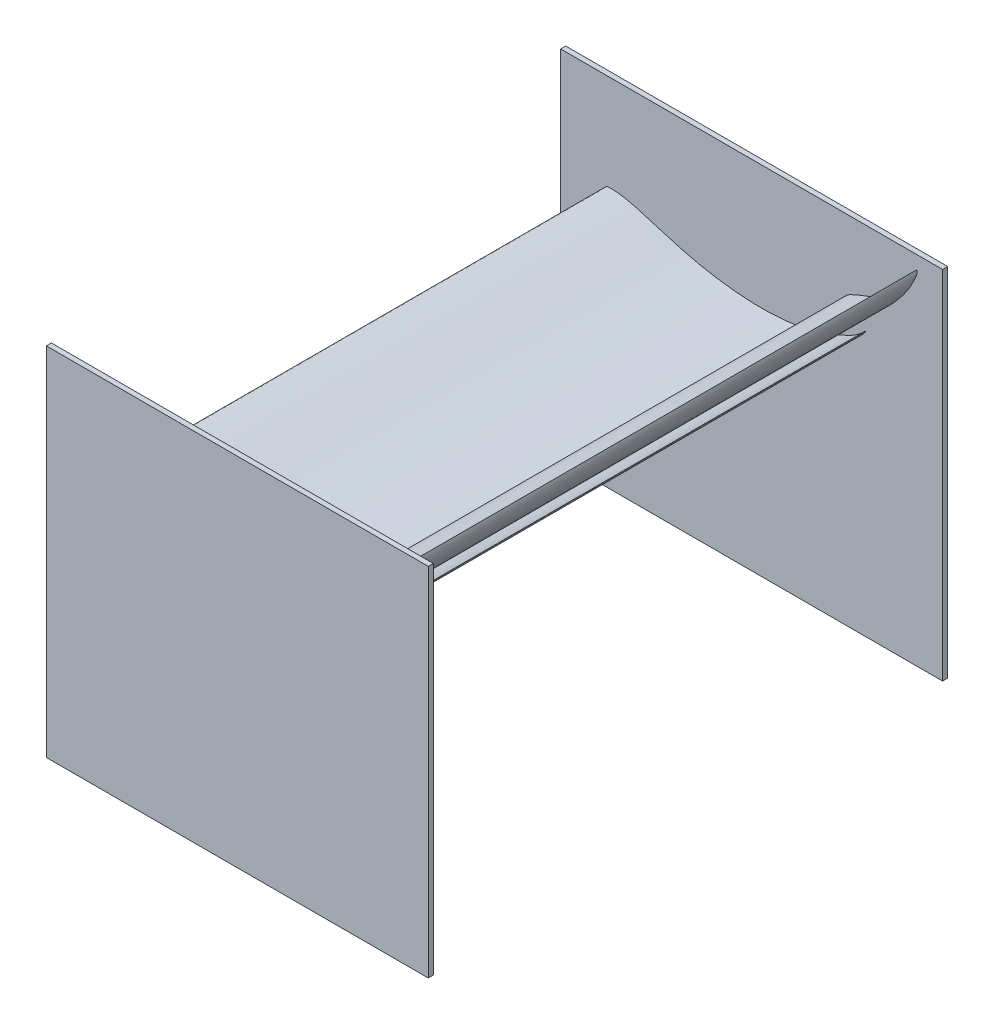
ISO-10303-21;
HEADER;
FILE_DESCRIPTION(('STEP AP214'),'2;1');
FILE_NAME('part.step','',(''),(''),'','','');
FILE_SCHEMA(('AUTOMOTIVE_DESIGN { 1 0 10303 214 1 1 1 1 }'));
ENDSEC;
DATA;
#1=APPLICATION_CONTEXT('core data for automotive mechanical design processes');
#2=APPLICATION_PROTOCOL_DEFINITION('international standard','automotive_design',2000,#1);
#3=PRODUCT_CONTEXT('',#1,'mechanical');
#4=PRODUCT('Part','Part','',(#3));
#5=PRODUCT_RELATED_PRODUCT_CATEGORY('part','',(#4));
#6=PRODUCT_DEFINITION_FORMATION('','',#4);
#7=PRODUCT_DEFINITION_CONTEXT('part definition',#1,'design');
#8=PRODUCT_DEFINITION('design','',#6,#7);
#9=PRODUCT_DEFINITION_SHAPE('','',#8);
#10=(LENGTH_UNIT() NAMED_UNIT(*) SI_UNIT(.MILLI.,.METRE.));
#11=(NAMED_UNIT(*) PLANE_ANGLE_UNIT() SI_UNIT($,.RADIAN.));
#12=(NAMED_UNIT(*) SI_UNIT($,.STERADIAN.) SOLID_ANGLE_UNIT());
#13=UNCERTAINTY_MEASURE_WITH_UNIT(LENGTH_MEASURE(1.E-05),#10,'distance_accuracy_value','');
#14=(GEOMETRIC_REPRESENTATION_CONTEXT(3) GLOBAL_UNCERTAINTY_ASSIGNED_CONTEXT((#13)) GLOBAL_UNIT_ASSIGNED_CONTEXT((#10,
#11,#12)) REPRESENTATION_CONTEXT('',''));
#15=CARTESIAN_POINT('',(0.,0.,0.));
#16=DIRECTION('',(0.,0.,1.));
#17=DIRECTION('',(1.,0.,0.));
#18=AXIS2_PLACEMENT_3D('',#15,#16,#17);
#19=CARTESIAN_POINT('',(0.,0.,0.));
#20=DIRECTION('',(0.,0.,1.));
#21=DIRECTION('',(1.,0.,0.));
#22=AXIS2_PLACEMENT_3D('',#19,#20,#21);
#23=PLANE('',#22);
#24=CARTESIAN_POINT('',(273.,1012.25924181801,0.));
#25=CARTESIAN_POINT('',(271.201415148747,1012.23435828406,0.));
#26=CARTESIAN_POINT('',(268.638301196031,1012.10630654016,0.));
#27=CARTESIAN_POINT('',(265.653250331693,1011.74538235126,0.));
#28=CARTESIAN_POINT('',(264.284362196398,1011.548108706,0.));
#29=CARTESIAN_POINT('',(263.539792153824,1011.35396756622,0.));
#30=CARTESIAN_POINT('',(263.12001111876,1011.19592984258,0.));
#31=CARTESIAN_POINT('',(262.768488908854,1011.01130756192,0.));
#32=CARTESIAN_POINT('',(262.468411330441,1010.79936806074,0.));
#33=CARTESIAN_POINT('',(262.177544141931,1010.52487738482,0.));
#34=CARTESIAN_POINT('',(261.858964948227,1010.13009683674,0.));
#35=CARTESIAN_POINT('',(261.458880229126,1009.47397081624,0.));
#36=CARTESIAN_POINT('',(261.138827884427,1008.75823921318,0.));
#37=CARTESIAN_POINT('',(260.750508018335,1007.7345244056,0.));
#38=CARTESIAN_POINT('',(260.410879648959,1006.53297471907,0.));
#39=CARTESIAN_POINT('',(260.173629484263,1004.91070666968,0.));
#40=CARTESIAN_POINT('',(260.13941744209,1003.41012733292,0.));
#41=CARTESIAN_POINT('',(260.27313462971,1001.44139672665,0.));
#42=CARTESIAN_POINT('',(260.782555660186,998.567405306258,0.));
#43=CARTESIAN_POINT('',(261.873874690585,995.076346138295,0.));
#44=CARTESIAN_POINT('',(263.361744472374,990.986939375976,0.));
#45=CARTESIAN_POINT('',(265.180686226828,986.801980019573,0.));
#46=CARTESIAN_POINT('',(267.77983881191,982.25547143078,0.));
#47=CARTESIAN_POINT('',(270.91334104746,977.735325610491,0.));
#48=CARTESIAN_POINT('',(274.700021760539,973.099063311374,0.));
#49=CARTESIAN_POINT('',(279.171373054781,968.374519326025,0.));
#50=CARTESIAN_POINT('',(284.345522139382,963.644591001402,0.));
#51=CARTESIAN_POINT('',(290.183245149152,958.986381350037,0.));
#52=CARTESIAN_POINT('',(296.717094047258,954.403777517736,0.));
#53=CARTESIAN_POINT('',(304.015560169979,949.867758318883,0.));
#54=CARTESIAN_POINT('',(310.809942199134,946.120548541329,0.));
#55=CARTESIAN_POINT('',(318.191111111886,942.440974345156,0.));
#56=CARTESIAN_POINT('',(326.031527311293,938.933915930958,0.));
#57=CARTESIAN_POINT('',(335.660586730226,935.20360414685,0.));
#58=CARTESIAN_POINT('',(345.771810982912,931.851683831538,0.));
#59=CARTESIAN_POINT('',(356.369810056878,928.892759607534,0.));
#60=CARTESIAN_POINT('',(367.435035994381,926.350660791032,0.));
#61=CARTESIAN_POINT('',(375.562703219898,924.858052745224,0.));
#62=CARTESIAN_POINT('',(384.366454556019,923.433542634873,0.));
#63=CARTESIAN_POINT('',(393.963489381055,922.110227338264,0.));
#64=CARTESIAN_POINT('',(408.404140054222,920.584624285058,0.));
#65=CARTESIAN_POINT('',(424.129292769142,919.343930143006,0.));
#66=CARTESIAN_POINT('',(440.685400213896,918.585353830072,0.));
#67=CARTESIAN_POINT('',(457.118588273314,918.417389982037,0.));
#68=CARTESIAN_POINT('',(473.14148547681,918.841128812992,0.));
#69=CARTESIAN_POINT('',(489.125316681511,919.804059999023,0.));
#70=CARTESIAN_POINT('',(505.619878678719,921.332372740582,0.));
#71=CARTESIAN_POINT('',(522.61829874122,923.449867137081,0.));
#72=CARTESIAN_POINT('',(540.176483883635,926.175896095973,0.));
#73=CARTESIAN_POINT('',(558.179483876056,929.495658400313,0.));
#74=CARTESIAN_POINT('',(576.891280692776,933.467710062593,0.));
#75=CARTESIAN_POINT('',(596.41418654349,938.134739827012,0.));
#76=CARTESIAN_POINT('',(615.797162739884,943.244139596153,0.));
#77=CARTESIAN_POINT('',(634.389199220082,948.642417750838,0.));
#78=CARTESIAN_POINT('',(652.177016953898,954.32198768344,0.));
#79=CARTESIAN_POINT('',(669.520103149398,960.429996542541,0.));
#80=CARTESIAN_POINT('',(686.621272384303,967.081991385223,0.));
#81=CARTESIAN_POINT('',(703.068353621244,974.084680916721,0.));
#82=CARTESIAN_POINT('',(718.218244574774,981.125930994245,0.));
#83=CARTESIAN_POINT('',(731.485958783864,987.757185122335,0.));
#84=CARTESIAN_POINT('',(741.837530825563,993.381442417973,0.));
#85=CARTESIAN_POINT('',(749.617640534613,997.94720127508,0.));
#86=CARTESIAN_POINT('',(755.337385709841,1001.63895892709,0.));
#87=CARTESIAN_POINT('',(759.901218231404,1005.07129786381,0.));
#88=CARTESIAN_POINT('',(763.865952974143,1008.62653853705,0.));
#89=CARTESIAN_POINT('',(767.565099629875,1012.77635199315,0.));
#90=CARTESIAN_POINT('',(770.140396094276,1016.23961020676,0.));
#91=CARTESIAN_POINT('',(775.003986101586,1023.74503667801,0.));
#92=CARTESIAN_POINT('',(767.091693748938,1014.45011604517,0.));
#93=CARTESIAN_POINT('',(762.558375476021,1010.95759865442,0.));
#94=CARTESIAN_POINT('',(756.271364406769,1005.97298116455,0.));
#95=CARTESIAN_POINT('',(749.915414366715,1001.85092177202,0.));
#96=CARTESIAN_POINT('',(742.894264123115,997.829531350645,0.));
#97=CARTESIAN_POINT('',(734.459884410433,993.596407295675,0.));
#98=CARTESIAN_POINT('',(722.29197576287,988.212819773536,0.));
#99=CARTESIAN_POINT('',(708.44043622718,982.515080661915,0.));
#100=CARTESIAN_POINT('',(694.14497943078,976.8922146943,0.));
#101=CARTESIAN_POINT('',(681.841199805663,972.612751126903,0.));
#102=CARTESIAN_POINT('',(669.553939318225,968.849439376123,0.));
#103=CARTESIAN_POINT('',(657.165523925718,965.631565478521,0.));
#104=CARTESIAN_POINT('',(644.510850095715,962.931905094162,0.));
#105=CARTESIAN_POINT('',(631.850350444526,960.805721591287,0.));
#106=CARTESIAN_POINT('',(618.844742750365,959.179174799612,0.));
#107=CARTESIAN_POINT('',(604.926422900628,957.914539319104,0.));
#108=CARTESIAN_POINT('',(589.603774285832,956.946708621309,0.));
#109=CARTESIAN_POINT('',(573.246215926208,956.434022709258,0.));
#110=CARTESIAN_POINT('',(556.568313850511,956.479808459582,0.));
#111=CARTESIAN_POINT('',(539.482515984937,957.12598922825,0.));
#112=CARTESIAN_POINT('',(522.002274169947,958.37814699541,0.));
#113=CARTESIAN_POINT('',(503.888277237014,960.244165175811,0.));
#114=CARTESIAN_POINT('',(485.336355768841,962.656998122039,0.));
#115=CARTESIAN_POINT('',(466.504189143325,965.62463758891,0.));
#116=CARTESIAN_POINT('',(447.855952683633,969.158051915528,0.));
#117=CARTESIAN_POINT('',(429.778332290122,973.191816944369,0.));
#118=CARTESIAN_POINT('',(411.529627983309,977.790405895988,0.));
#119=CARTESIAN_POINT('',(392.160420714307,983.159709982241,0.));
#120=CARTESIAN_POINT('',(371.081584087628,989.483541486512,0.));
#121=CARTESIAN_POINT('',(350.337592860187,995.995425315817,0.));
#122=CARTESIAN_POINT('',(331.858264003342,1001.51234235153,0.));
#123=CARTESIAN_POINT('',(317.239829947766,1005.46533479693,0.));
#124=CARTESIAN_POINT('',(305.493691746019,1008.27874256939,0.));
#125=CARTESIAN_POINT('',(295.635216434035,1010.22462020661,0.));
#126=CARTESIAN_POINT('',(287.048551222329,1011.49452318452,0.));
#127=CARTESIAN_POINT('',(279.643741661833,1012.16128227725,0.));
#128=CARTESIAN_POINT('',(275.063951815474,1012.28779672051,0.));
#129=CARTESIAN_POINT('',(273.,1012.25924181801,0.));
#130=B_SPLINE_CURVE_WITH_KNOTS('',3,(#24,#25,#26,#27,#28,#29,#30,#31,#32,#33,#34,#35,#36,#37,
#38,#39,#40,#41,#42,#43,#44,#45,#46,#47,#48,#49,#50,#51,#52,#53,#54,#55,#56,#57,#58,#59,#60,#61,
#62,#63,#64,#65,#66,#67,#68,#69,#70,#71,#72,#73,#74,#75,#76,#77,#78,#79,#80,#81,#82,#83,#84,#85,
#86,#87,#88,#89,#90,#91,#92,#93,#94,#95,#96,#97,#98,#99,#100,#101,#102,#103,#104,#105,#106,#107,
#108,#109,#110,#111,#112,#113,#114,#115,#116,#117,#118,#119,#120,#121,#122,#123,#124,#125,#126,
#127,#128,#129),.UNSPECIFIED.,.T.,.F.,(4,1,1,1,1,1,1,1,1,1,1,1,1,1,1,1,1,1,1,1,1,1,1,1,1,1,1,1,
1,1,1,1,1,1,1,1,1,1,1,1,1,1,1,1,1,1,1,1,1,1,1,1,1,1,1,1,1,1,1,1,1,1,1,1,1,1,1,1,1,1,1,1,1,1,1,1,
1,1,1,1,1,1,1,1,1,1,1,1,1,1,1,1,1,1,1,1,1,1,1,1,1,1,1,4),(0.,0.00486498720637252,
0.00693254524521891,0.00813788435669305,0.00860149727128035,0.00901181840696386,
0.00934865279773456,0.0096731642835618,0.0100026596108538,0.0104275748205012,0.0110418174822611,
0.0120766326629139,0.0125434720315457,0.014004596260203,0.0154435818399652,0.0169687663105577,
0.0180560683135106,0.0207795247726854,0.0248406343782316,0.0279358855564014,0.0325554535440554,
0.0371663626143194,0.0420821080159116,0.0474218776089789,0.0533481896207324,0.0596674467011705,
0.0663745655860388,0.0735423368115471,0.0812490197247285,0.0896154033323993,0.0945263674953617,
0.103562344523124,0.112843807907009,0.122455999221578,0.132373756408963,0.14260534815104,
0.153165587614205,0.154726060672372,0.166736316983418,0.179371763289159,0.194012659114079,
0.209411026755962,0.224206692179842,0.238469752089365,0.252771690585992,0.267526239366753,
0.283284172444976,0.299113578757103,0.315597400733655,0.332811402570589,0.350865810671034,
0.369905470866038,0.387043715821497,0.403243824516595,0.420423249014811,0.436786871378303,
0.452885030332324,0.468782715546349,0.48198343638645,0.49301168675148,0.500654808832816,
0.506381799232014,0.511437541320662,0.516043966627856,0.520925913945336,0.525830531207915,
0.529953558671425,0.536609682497579,0.543291188228846,0.550106034163821,0.557026954660342,
0.564113346016075,0.571894396282258,0.58258008266935,0.600094179547477,0.61242484092006,
0.624138462179078,0.635332149629944,0.64718748312066,0.6587592246628,0.670332543322906,
0.681912601165571,0.694215176194797,0.708142392645253,0.723449251782781,0.73848835212507,
0.753260173450307,0.769704083265492,0.785898215648005,0.802525572661821,0.820318822274027,
0.837475337311733,0.853872349782661,0.870428328602395,0.888390885544636,0.908253004939095,
0.929971273954701,0.947220557189022,0.960430627996534,0.970941391538835,0.979895840022844,
0.987611288807097,0.99441722242359,1.),.UNSPECIFIED.);
#131=CARTESIAN_POINT('',(273.,1012.25924181801,0.));
#132=VERTEX_POINT('',#131);
#133=EDGE_CURVE('E80',#132,#132,#130,.T.);
#134=ORIENTED_EDGE('',*,*,#133,.F.);
#135=EDGE_LOOP('',(#134));
#136=FACE_BOUND('',#135,.T.);
#137=DIRECTION('',(0.,-1.,0.));
#138=VECTOR('',#137,1.);
#139=CARTESIAN_POINT('',(923.,0.,0.));
#140=LINE('',#139,#138);
#141=CARTESIAN_POINT('',(923.,1200.,0.));
#142=VERTEX_POINT('',#141);
#143=CARTESIAN_POINT('',(923.,500.,0.));
#144=VERTEX_POINT('',#143);
#145=EDGE_CURVE('E201',#142,#144,#140,.T.);
#146=ORIENTED_EDGE('',*,*,#145,.F.);
#147=DIRECTION('',(1.,0.,0.));
#148=VECTOR('',#147,1.);
#149=CARTESIAN_POINT('',(0.,1200.,0.));
#150=LINE('',#149,#148);
#151=CARTESIAN_POINT('',(173.,1200.,0.));
#152=VERTEX_POINT('',#151);
#153=EDGE_CURVE('E249',#152,#142,#150,.T.);
#154=ORIENTED_EDGE('',*,*,#153,.F.);
#155=DIRECTION('',(0.,-1.,0.));
#156=VECTOR('',#155,1.);
#157=CARTESIAN_POINT('',(173.,0.,0.));
#158=LINE('',#157,#156);
#159=CARTESIAN_POINT('',(173.,500.,0.));
#160=VERTEX_POINT('',#159);
#161=EDGE_CURVE('E253',#152,#160,#158,.T.);
#162=ORIENTED_EDGE('',*,*,#161,.T.);
#163=DIRECTION('',(1.,0.,0.));
#164=VECTOR('',#163,1.);
#165=CARTESIAN_POINT('',(0.,500.,0.));
#166=LINE('',#165,#164);
#167=EDGE_CURVE('E251',#160,#144,#166,.T.);
#168=ORIENTED_EDGE('',*,*,#167,.T.);
#169=EDGE_LOOP('',(#146,#154,#162,#168));
#170=FACE_BOUND('',#169,.T.);
#171=CARTESIAN_POINT('',(735.098118118824,1062.25924181801,0.));
#172=CARTESIAN_POINT('',(734.601409278012,1061.85735257116,0.));
#173=CARTESIAN_POINT('',(733.913894671449,1061.25877943433,0.));
#174=CARTESIAN_POINT('',(733.159708622118,1060.50253640022,0.));
#175=CARTESIAN_POINT('',(732.820827238944,1060.14686987799,0.));
#176=CARTESIAN_POINT('',(732.655570391528,1059.92916864501,0.));
#177=CARTESIAN_POINT('',(732.573068321793,1059.79286633193,0.));
#178=CARTESIAN_POINT('',(732.515461980444,1059.66413008372,0.));
#179=CARTESIAN_POINT('',(732.478217651569,1059.53906319835,0.));
#180=CARTESIAN_POINT('',(732.457280183292,1059.3985542074,0.));
#181=CARTESIAN_POINT('',(732.455019211402,1059.21837461819,0.));
#182=CARTESIAN_POINT('',(732.487388992846,1058.94732884811,0.));
#183=CARTESIAN_POINT('',(732.555192640813,1058.67721481669,0.));
#184=CARTESIAN_POINT('',(732.671564082484,1058.30612000503,0.));
#185=CARTESIAN_POINT('',(732.840580218898,1057.8960648109,0.));
#186=CARTESIAN_POINT('',(733.130564106155,1057.39102386409,0.));
#187=CARTESIAN_POINT('',(733.450516164215,1056.96454300491,0.));
#188=CARTESIAN_POINT('',(733.92015364958,1056.44422691465,0.));
#189=CARTESIAN_POINT('',(734.693470710875,1055.75365678495,0.));
#190=CARTESIAN_POINT('',(735.764754894848,1055.01857447579,0.));
#191=CARTESIAN_POINT('',(737.078145767434,1054.20350732349,0.));
#192=CARTESIAN_POINT('',(738.504955290504,1053.43445979079,0.));
#193=CARTESIAN_POINT('',(740.228993812095,1052.73578844025,0.));
#194=CARTESIAN_POINT('',(742.096436271006,1052.16181268128,0.));
#195=CARTESIAN_POINT('',(744.171746461747,1051.69884466315,0.));
#196=CARTESIAN_POINT('',(746.457605025969,1051.36157116668,0.));
#197=CARTESIAN_POINT('',(748.940870174795,1051.17711795674,0.));
#198=CARTESIAN_POINT('',(751.59365979152,1051.15839957771,0.));
#199=CARTESIAN_POINT('',(754.424208971306,1051.31364924994,0.));
#200=CARTESIAN_POINT('',(757.458013406952,1051.64980377664,0.));
#201=CARTESIAN_POINT('',(760.17786487035,1052.09550826194,0.));
#202=CARTESIAN_POINT('',(763.046698102758,1052.68894630391,0.));
#203=CARTESIAN_POINT('',(766.005873398141,1053.43139518083,0.));
#204=CARTESIAN_POINT('',(769.513468845689,1054.50426934847,0.));
#205=CARTESIAN_POINT('',(773.07259789331,1055.78866809965,0.));
#206=CARTESIAN_POINT('',(776.681340718827,1057.28968139248,0.));
#207=CARTESIAN_POINT('',(780.329006893166,1059.00967004613,0.));
#208=CARTESIAN_POINT('',(782.926041540517,1060.37763833863,0.));
#209=CARTESIAN_POINT('',(785.69688861364,1061.91307758086,0.));
#210=CARTESIAN_POINT('',(788.66700313281,1063.65096375463,0.));
#211=CARTESIAN_POINT('',(793.033896011037,1066.39595405539,0.));
#212=CARTESIAN_POINT('',(797.696865939531,1069.50254914191,0.));
#213=CARTESIAN_POINT('',(802.485976438912,1072.92621858554,0.));
#214=CARTESIAN_POINT('',(807.111077858893,1076.48779844185,0.));
#215=CARTESIAN_POINT('',(811.491695413534,1080.12449073513,0.));
#216=CARTESIAN_POINT('',(815.743007194576,1083.90314963581,0.));
#217=CARTESIAN_POINT('',(820.012768162593,1087.95181422974,0.));
#218=CARTESIAN_POINT('',(824.293833284726,1092.27562046494,0.));
#219=CARTESIAN_POINT('',(828.5975624462,1096.89224808229,0.));
#220=CARTESIAN_POINT('',(832.895111152251,1101.77232320842,0.));
#221=CARTESIAN_POINT('',(837.247326340797,1106.99016133588,0.));
#222=CARTESIAN_POINT('',(841.673400241829,1112.5801475441,0.));
#223=CARTESIAN_POINT('',(845.96326749186,1118.26291901713,0.));
#224=CARTESIAN_POINT('',(849.968867594461,1123.85266838586,0.));
#225=CARTESIAN_POINT('',(853.688158888098,1129.34436156432,0.));
#226=CARTESIAN_POINT('',(857.18920054135,1134.85802056879,0.));
#227=CARTESIAN_POINT('',(860.503246923695,1140.47044162237,0.));
#228=CARTESIAN_POINT('',(863.557661854213,1146.03715049706,0.));
#229=CARTESIAN_POINT('',(866.241428188326,1151.32978255261,0.));
#230=CARTESIAN_POINT('',(868.489711234654,1156.09464476555,0.));
#231=CARTESIAN_POINT('',(870.144915491614,1159.93800888438,0.));
#232=CARTESIAN_POINT('',(871.314586063783,1162.92118183816,0.));
#233=CARTESIAN_POINT('',(872.100910964526,1165.20790531374,0.));
#234=CARTESIAN_POINT('',(872.621464287459,1167.16837723733,0.));
#235=CARTESIAN_POINT('',(872.94775951144,1169.03161118636,0.));
#236=CARTESIAN_POINT('',(873.0693422954,1171.00253342726,0.));
#237=CARTESIAN_POINT('',(873.027898115125,1172.53498612471,0.));
#238=CARTESIAN_POINT('',(872.737757494877,1175.69850433591,0.));
#239=CARTESIAN_POINT('',(872.569632349551,1171.36590311654,0.));
#240=CARTESIAN_POINT('',(872.070813006159,1169.39532956223,0.));
#241=CARTESIAN_POINT('',(871.409997142404,1166.62307098272,0.));
#242=CARTESIAN_POINT('',(870.540528680057,1164.07650451628,0.));
#243=CARTESIAN_POINT('',(869.463228002351,1161.41197750953,0.));
#244=CARTESIAN_POINT('',(868.037840835745,1158.3780100106,0.));
#245=CARTESIAN_POINT('',(865.822659934905,1154.20300229535,0.));
#246=CARTESIAN_POINT('',(863.206384679933,1149.57058253425,0.));
#247=CARTESIAN_POINT('',(860.449724758716,1144.86159026431,0.));
#248=CARTESIAN_POINT('',(857.954159387466,1140.9650236807,0.));
#249=CARTESIAN_POINT('',(855.349867208679,1137.21619632738,0.));
#250=CARTESIAN_POINT('',(852.597562342133,1133.59744558054,0.));
#251=CARTESIAN_POINT('',(849.657125195447,1130.06491607947,0.));
#252=CARTESIAN_POINT('',(846.589134724193,1126.69122461121,0.));
#253=CARTESIAN_POINT('',(843.315075993406,1123.3812534988,0.));
#254=CARTESIAN_POINT('',(839.706713798404,1119.97191203907,0.));
#255=CARTESIAN_POINT('',(835.641082992384,1116.33707073101,0.));
#256=CARTESIAN_POINT('',(831.186557970818,1112.60205755926,0.));
#257=CARTESIAN_POINT('',(826.519959746755,1108.95262958961,0.));
#258=CARTESIAN_POINT('',(821.607637665998,1105.38126691649,0.));
#259=CARTESIAN_POINT('',(816.452121824935,1101.89248187144,0.));
#260=CARTESIAN_POINT('',(810.984864404838,1098.43592647592,0.));
#261=CARTESIAN_POINT('',(805.27526437074,1095.0358826803,0.));
#262=CARTESIAN_POINT('',(799.365591638865,1091.72920579154,0.));
#263=CARTESIAN_POINT('',(793.383037543128,1088.6208840019,0.));
#264=CARTESIAN_POINT('',(787.4499326471,1085.77756089009,0.));
#265=CARTESIAN_POINT('',(781.345033689831,1083.05437172365,0.));
#266=CARTESIAN_POINT('',(774.758048100741,1080.30032437925,0.));
#267=CARTESIAN_POINT('',(767.484126813329,1077.43737694059,0.));
#268=CARTESIAN_POINT('',(760.262402442463,1074.70046146188,0.));
#269=CARTESIAN_POINT('',(753.891461320445,1072.18303196276,0.));
#270=CARTESIAN_POINT('',(748.94191304318,1070.07674106288,0.));
#271=CARTESIAN_POINT('',(745.044557852284,1068.28298518338,0.));
#272=CARTESIAN_POINT('',(741.864742843782,1066.66151285977,0.));
#273=CARTESIAN_POINT('',(739.188456536839,1065.13057540319,0.));
#274=CARTESIAN_POINT('',(736.974590728318,1063.6907548718,0.));
#275=CARTESIAN_POINT('',(735.668112419088,1062.72042664344,0.));
#276=CARTESIAN_POINT('',(735.098118118824,1062.25924181801,0.));
#277=B_SPLINE_CURVE_WITH_KNOTS('',3,(#171,#172,#173,#174,#175,#176,#177,#178,#179,#180,#181,
#182,#183,#184,#185,#186,#187,#188,#189,#190,#191,#192,#193,#194,#195,#196,#197,#198,#199,#200,
#201,#202,#203,#204,#205,#206,#207,#208,#209,#210,#211,#212,#213,#214,#215,#216,#217,#218,#219,
#220,#221,#222,#223,#224,#225,#226,#227,#228,#229,#230,#231,#232,#233,#234,#235,#236,#237,#238,
#239,#240,#241,#242,#243,#244,#245,#246,#247,#248,#249,#250,#251,#252,#253,#254,#255,#256,#257,
#258,#259,#260,#261,#262,#263,#264,#265,#266,#267,#268,#269,#270,#271,#272,#273,#274,#275,#276),
.UNSPECIFIED.,.T.,.F.,(4,1,1,1,1,1,1,1,1,1,1,1,1,1,1,1,1,1,1,1,1,1,1,1,1,1,1,1,1,1,1,1,1,1,1,1,
1,1,1,1,1,1,1,1,1,1,1,1,1,1,1,1,1,1,1,1,1,1,1,1,1,1,1,1,1,1,1,1,1,1,1,1,1,1,1,1,1,1,1,1,1,1,1,1,
1,1,1,1,1,1,1,1,1,1,1,1,1,1,1,1,1,1,1,4),(0.,0.00486498720637252,0.00693254524521891,
0.00813788435669305,0.00860149727128035,0.00901181840696386,0.00934865279773456,
0.0096731642835618,0.0100026596108538,0.0104275748205012,0.0110418174822611,0.0120766326629139,
0.0125434720315457,0.014004596260203,0.0154435818399652,0.0169687663105577,0.0180560683135106,
0.0207795247726854,0.0248406343782316,0.0279358855564014,0.0325554535440554,0.0371663626143194,
0.0420821080159116,0.0474218776089789,0.0533481896207324,0.0596674467011705,0.0663745655860388,
0.0735423368115471,0.0812490197247285,0.0896154033323993,0.0945263674953617,0.103562344523124,
0.112843807907009,0.122455999221578,0.132373756408963,0.14260534815104,0.153165587614205,
0.154726060672372,0.166736316983418,0.179371763289159,0.194012659114079,0.209411026755962,
0.224206692179842,0.238469752089365,0.252771690585992,0.267526239366753,0.283284172444976,
0.299113578757103,0.315597400733655,0.332811402570589,0.350865810671034,0.369905470866038,
0.387043715821497,0.403243824516595,0.420423249014811,0.436786871378303,0.452885030332324,
0.468782715546349,0.48198343638645,0.49301168675148,0.500654808832816,0.506381799232014,
0.511437541320662,0.516043966627856,0.520925913945336,0.525830531207915,0.529953558671425,
0.536609682497579,0.543291188228846,0.550106034163821,0.557026954660342,0.564113346016075,
0.571894396282258,0.58258008266935,0.600094179547477,0.61242484092006,0.624138462179078,
0.635332149629944,0.64718748312066,0.6587592246628,0.670332543322906,0.681912601165571,
0.694215176194797,0.708142392645253,0.723449251782781,0.73848835212507,0.753260173450307,
0.769704083265492,0.785898215648005,0.802525572661821,0.820318822274027,0.837475337311733,
0.853872349782661,0.870428328602395,0.888390885544636,0.908253004939095,0.929971273954701,
0.947220557189022,0.960430627996534,0.970941391538835,0.979895840022844,0.987611288807097,
0.99441722242359,1.),.UNSPECIFIED.);
#278=CARTESIAN_POINT('',(735.098118118824,1062.25924181801,0.));
#279=VERTEX_POINT('',#278);
#280=EDGE_CURVE('E196',#279,#279,#277,.T.);
#281=ORIENTED_EDGE('',*,*,#280,.F.);
#282=EDGE_LOOP('',(#281));
#283=FACE_BOUND('',#282,.T.);
#284=ADVANCED_FACE('F75',(#136,#170,#283),#23,.T.);
#285=CARTESIAN_POINT('',(273.,1012.25924181801,1000.));
#286=CARTESIAN_POINT('',(271.201415148747,1012.23435828406,1000.));
#287=CARTESIAN_POINT('',(268.638301196031,1012.10630654016,1000.));
#288=CARTESIAN_POINT('',(265.653250331693,1011.74538235126,1000.));
#289=CARTESIAN_POINT('',(264.284362196398,1011.548108706,1000.));
#290=CARTESIAN_POINT('',(263.539792153824,1011.35396756622,1000.));
#291=CARTESIAN_POINT('',(263.12001111876,1011.19592984258,1000.));
#292=CARTESIAN_POINT('',(262.768488908854,1011.01130756192,1000.));
#293=CARTESIAN_POINT('',(262.468411330441,1010.79936806074,1000.));
#294=CARTESIAN_POINT('',(262.177544141931,1010.52487738482,1000.));
#295=CARTESIAN_POINT('',(261.858964948227,1010.13009683674,1000.));
#296=CARTESIAN_POINT('',(261.458880229126,1009.47397081624,1000.));
#297=CARTESIAN_POINT('',(261.138827884427,1008.75823921318,1000.));
#298=CARTESIAN_POINT('',(260.750508018335,1007.7345244056,1000.));
#299=CARTESIAN_POINT('',(260.410879648959,1006.53297471907,1000.));
#300=CARTESIAN_POINT('',(260.173629484263,1004.91070666968,1000.));
#301=CARTESIAN_POINT('',(260.13941744209,1003.41012733292,1000.));
#302=CARTESIAN_POINT('',(260.27313462971,1001.44139672665,1000.));
#303=CARTESIAN_POINT('',(260.782555660186,998.567405306258,1000.));
#304=CARTESIAN_POINT('',(261.873874690585,995.076346138295,1000.));
#305=CARTESIAN_POINT('',(263.361744472374,990.986939375976,1000.));
#306=CARTESIAN_POINT('',(265.180686226828,986.801980019573,1000.));
#307=CARTESIAN_POINT('',(267.77983881191,982.25547143078,1000.));
#308=CARTESIAN_POINT('',(270.91334104746,977.735325610491,1000.));
#309=CARTESIAN_POINT('',(274.700021760539,973.099063311374,1000.));
#310=CARTESIAN_POINT('',(279.171373054781,968.374519326025,1000.));
#311=CARTESIAN_POINT('',(284.345522139382,963.644591001402,1000.));
#312=CARTESIAN_POINT('',(290.183245149152,958.986381350037,1000.));
#313=CARTESIAN_POINT('',(296.717094047258,954.403777517736,1000.));
#314=CARTESIAN_POINT('',(304.015560169979,949.867758318883,1000.));
#315=CARTESIAN_POINT('',(310.809942199134,946.120548541329,1000.));
#316=CARTESIAN_POINT('',(318.191111111886,942.440974345156,1000.));
#317=CARTESIAN_POINT('',(326.031527311293,938.933915930958,1000.));
#318=CARTESIAN_POINT('',(335.660586730226,935.20360414685,1000.));
#319=CARTESIAN_POINT('',(345.771810982912,931.851683831538,1000.));
#320=CARTESIAN_POINT('',(356.369810056878,928.892759607534,1000.));
#321=CARTESIAN_POINT('',(367.435035994381,926.350660791032,1000.));
#322=CARTESIAN_POINT('',(375.562703219898,924.858052745224,1000.));
#323=CARTESIAN_POINT('',(384.366454556019,923.433542634873,1000.));
#324=CARTESIAN_POINT('',(393.963489381055,922.110227338264,1000.));
#325=CARTESIAN_POINT('',(408.404140054222,920.584624285058,1000.));
#326=CARTESIAN_POINT('',(424.129292769142,919.343930143006,1000.));
#327=CARTESIAN_POINT('',(440.685400213896,918.585353830072,1000.));
#328=CARTESIAN_POINT('',(457.118588273314,918.417389982037,1000.));
#329=CARTESIAN_POINT('',(473.14148547681,918.841128812992,1000.));
#330=CARTESIAN_POINT('',(489.125316681511,919.804059999023,1000.));
#331=CARTESIAN_POINT('',(505.619878678719,921.332372740582,1000.));
#332=CARTESIAN_POINT('',(522.61829874122,923.449867137081,1000.));
#333=CARTESIAN_POINT('',(540.176483883635,926.175896095973,1000.));
#334=CARTESIAN_POINT('',(558.179483876056,929.495658400313,1000.));
#335=CARTESIAN_POINT('',(576.891280692776,933.467710062593,1000.));
#336=CARTESIAN_POINT('',(596.41418654349,938.134739827012,1000.));
#337=CARTESIAN_POINT('',(615.797162739884,943.244139596153,1000.));
#338=CARTESIAN_POINT('',(634.389199220082,948.642417750838,1000.));
#339=CARTESIAN_POINT('',(652.177016953898,954.32198768344,1000.));
#340=CARTESIAN_POINT('',(669.520103149398,960.429996542541,1000.));
#341=CARTESIAN_POINT('',(686.621272384303,967.081991385223,1000.));
#342=CARTESIAN_POINT('',(703.068353621244,974.084680916721,1000.));
#343=CARTESIAN_POINT('',(718.218244574774,981.125930994245,1000.));
#344=CARTESIAN_POINT('',(731.485958783864,987.757185122335,1000.));
#345=CARTESIAN_POINT('',(741.837530825563,993.381442417973,1000.));
#346=CARTESIAN_POINT('',(749.617640534613,997.94720127508,1000.));
#347=CARTESIAN_POINT('',(755.337385709841,1001.63895892709,1000.));
#348=CARTESIAN_POINT('',(759.901218231404,1005.07129786381,1000.));
#349=CARTESIAN_POINT('',(763.865952974143,1008.62653853705,1000.));
#350=CARTESIAN_POINT('',(767.565099629875,1012.77635199315,1000.));
#351=CARTESIAN_POINT('',(770.140396094276,1016.23961020676,1000.));
#352=CARTESIAN_POINT('',(775.003986101586,1023.74503667801,1000.));
#353=CARTESIAN_POINT('',(767.091693748938,1014.45011604517,1000.));
#354=CARTESIAN_POINT('',(762.558375476021,1010.95759865442,1000.));
#355=CARTESIAN_POINT('',(756.271364406769,1005.97298116455,1000.));
#356=CARTESIAN_POINT('',(749.915414366715,1001.85092177202,1000.));
#357=CARTESIAN_POINT('',(742.894264123115,997.829531350645,1000.));
#358=CARTESIAN_POINT('',(734.459884410433,993.596407295675,1000.));
#359=CARTESIAN_POINT('',(722.29197576287,988.212819773536,1000.));
#360=CARTESIAN_POINT('',(708.44043622718,982.515080661915,1000.));
#361=CARTESIAN_POINT('',(694.14497943078,976.8922146943,1000.));
#362=CARTESIAN_POINT('',(681.841199805663,972.612751126903,1000.));
#363=CARTESIAN_POINT('',(669.553939318225,968.849439376123,1000.));
#364=CARTESIAN_POINT('',(657.165523925718,965.631565478521,1000.));
#365=CARTESIAN_POINT('',(644.510850095715,962.931905094162,1000.));
#366=CARTESIAN_POINT('',(631.850350444526,960.805721591287,1000.));
#367=CARTESIAN_POINT('',(618.844742750365,959.179174799612,1000.));
#368=CARTESIAN_POINT('',(604.926422900628,957.914539319104,1000.));
#369=CARTESIAN_POINT('',(589.603774285832,956.946708621309,1000.));
#370=CARTESIAN_POINT('',(573.246215926208,956.434022709258,1000.));
#371=CARTESIAN_POINT('',(556.568313850511,956.479808459582,1000.));
#372=CARTESIAN_POINT('',(539.482515984937,957.12598922825,1000.));
#373=CARTESIAN_POINT('',(522.002274169947,958.37814699541,1000.));
#374=CARTESIAN_POINT('',(503.888277237014,960.244165175811,1000.));
#375=CARTESIAN_POINT('',(485.336355768841,962.656998122039,1000.));
#376=CARTESIAN_POINT('',(466.504189143325,965.62463758891,1000.));
#377=CARTESIAN_POINT('',(447.855952683633,969.158051915528,1000.));
#378=CARTESIAN_POINT('',(429.778332290122,973.191816944369,1000.));
#379=CARTESIAN_POINT('',(411.529627983309,977.790405895988,1000.));
#380=CARTESIAN_POINT('',(392.160420714307,983.159709982241,1000.));
#381=CARTESIAN_POINT('',(371.081584087628,989.483541486512,1000.));
#382=CARTESIAN_POINT('',(350.337592860187,995.995425315817,1000.));
#383=CARTESIAN_POINT('',(331.858264003342,1001.51234235153,1000.));
#384=CARTESIAN_POINT('',(317.239829947766,1005.46533479693,1000.));
#385=CARTESIAN_POINT('',(305.493691746019,1008.27874256939,1000.));
#386=CARTESIAN_POINT('',(295.635216434035,1010.22462020661,1000.));
#387=CARTESIAN_POINT('',(287.048551222329,1011.49452318452,1000.));
#388=CARTESIAN_POINT('',(279.643741661833,1012.16128227725,1000.));
#389=CARTESIAN_POINT('',(275.063951815474,1012.28779672051,1000.));
#390=CARTESIAN_POINT('',(273.,1012.25924181801,1000.));
#391=B_SPLINE_CURVE_WITH_KNOTS('',3,(#285,#286,#287,#288,#289,#290,#291,#292,#293,#294,#295,
#296,#297,#298,#299,#300,#301,#302,#303,#304,#305,#306,#307,#308,#309,#310,#311,#312,#313,#314,
#315,#316,#317,#318,#319,#320,#321,#322,#323,#324,#325,#326,#327,#328,#329,#330,#331,#332,#333,
#334,#335,#336,#337,#338,#339,#340,#341,#342,#343,#344,#345,#346,#347,#348,#349,#350,#351,#352,
#353,#354,#355,#356,#357,#358,#359,#360,#361,#362,#363,#364,#365,#366,#367,#368,#369,#370,#371,
#372,#373,#374,#375,#376,#377,#378,#379,#380,#381,#382,#383,#384,#385,#386,#387,#388,#389,#390),
.UNSPECIFIED.,.T.,.F.,(4,1,1,1,1,1,1,1,1,1,1,1,1,1,1,1,1,1,1,1,1,1,1,1,1,1,1,1,1,1,1,1,1,1,1,1,
1,1,1,1,1,1,1,1,1,1,1,1,1,1,1,1,1,1,1,1,1,1,1,1,1,1,1,1,1,1,1,1,1,1,1,1,1,1,1,1,1,1,1,1,1,1,1,1,
1,1,1,1,1,1,1,1,1,1,1,1,1,1,1,1,1,1,1,4),(0.,0.00486498720637252,0.00693254524521891,
0.00813788435669305,0.00860149727128035,0.00901181840696386,0.00934865279773456,
0.0096731642835618,0.0100026596108538,0.0104275748205012,0.0110418174822611,0.0120766326629139,
0.0125434720315457,0.014004596260203,0.0154435818399652,0.0169687663105577,0.0180560683135106,
0.0207795247726854,0.0248406343782316,0.0279358855564014,0.0325554535440554,0.0371663626143194,
0.0420821080159116,0.0474218776089789,0.0533481896207324,0.0596674467011705,0.0663745655860388,
0.0735423368115471,0.0812490197247285,0.0896154033323993,0.0945263674953617,0.103562344523124,
0.112843807907009,0.122455999221578,0.132373756408963,0.14260534815104,0.153165587614205,
0.154726060672372,0.166736316983418,0.179371763289159,0.194012659114079,0.209411026755962,
0.224206692179842,0.238469752089365,0.252771690585992,0.267526239366753,0.283284172444976,
0.299113578757103,0.315597400733655,0.332811402570589,0.350865810671034,0.369905470866038,
0.387043715821497,0.403243824516595,0.420423249014811,0.436786871378303,0.452885030332324,
0.468782715546349,0.48198343638645,0.49301168675148,0.500654808832816,0.506381799232014,
0.511437541320662,0.516043966627856,0.520925913945336,0.525830531207915,0.529953558671425,
0.536609682497579,0.543291188228846,0.550106034163821,0.557026954660342,0.564113346016075,
0.571894396282258,0.58258008266935,0.600094179547477,0.61242484092006,0.624138462179078,
0.635332149629944,0.64718748312066,0.6587592246628,0.670332543322906,0.681912601165571,
0.694215176194797,0.708142392645253,0.723449251782781,0.73848835212507,0.753260173450307,
0.769704083265492,0.785898215648005,0.802525572661821,0.820318822274027,0.837475337311733,
0.853872349782661,0.870428328602395,0.888390885544636,0.908253004939095,0.929971273954701,
0.947220557189022,0.960430627996534,0.970941391538835,0.979895840022844,0.987611288807097,
0.99441722242359,1.),.UNSPECIFIED.);
#392=DIRECTION('',(0.,0.,-1.));
#393=VECTOR('',#392,1.);
#394=SURFACE_OF_LINEAR_EXTRUSION('',#391,#393);
#395=CARTESIAN_POINT('',(273.,1012.25924181801,1000.));
#396=VERTEX_POINT('',#395);
#397=EDGE_CURVE('E12',#396,#396,#391,.T.);
#398=ORIENTED_EDGE('',*,*,#397,.F.);
#399=EDGE_LOOP('',(#398));
#400=FACE_BOUND('',#399,.T.);
#401=ORIENTED_EDGE('',*,*,#133,.T.);
#402=EDGE_LOOP('',(#401));
#403=FACE_BOUND('',#402,.T.);
#404=ADVANCED_FACE('F77',(#400,#403),#394,.F.);
#405=CARTESIAN_POINT('',(923.,0.,-10.));
#406=DIRECTION('',(-1.,0.,0.));
#407=DIRECTION('',(0.,0.,1.));
#408=AXIS2_PLACEMENT_3D('',#405,#406,#407);
#409=PLANE('',#408);
#410=ORIENTED_EDGE('',*,*,#145,.T.);
#411=DIRECTION('',(0.,0.,1.));
#412=VECTOR('',#411,1.);
#413=CARTESIAN_POINT('',(923.,500.,-10.));
#414=LINE('',#413,#412);
#415=CARTESIAN_POINT('',(923.,500.,-10.));
#416=VERTEX_POINT('',#415);
#417=EDGE_CURVE('E119',#416,#144,#414,.T.);
#418=ORIENTED_EDGE('',*,*,#417,.F.);
#419=DIRECTION('',(0.,-1.,0.));
#420=VECTOR('',#419,1.);
#421=CARTESIAN_POINT('',(923.,0.,-10.));
#422=LINE('',#421,#420);
#423=CARTESIAN_POINT('',(923.,1200.,-10.));
#424=VERTEX_POINT('',#423);
#425=EDGE_CURVE('E94',#424,#416,#422,.T.);
#426=ORIENTED_EDGE('',*,*,#425,.F.);
#427=DIRECTION('',(0.,0.,1.));
#428=VECTOR('',#427,1.);
#429=CARTESIAN_POINT('',(923.,1200.,-10.));
#430=LINE('',#429,#428);
#431=EDGE_CURVE('E246',#424,#142,#430,.T.);
#432=ORIENTED_EDGE('',*,*,#431,.T.);
#433=EDGE_LOOP('',(#410,#418,#426,#432));
#434=FACE_BOUND('',#433,.T.);
#435=ADVANCED_FACE('F232',(#434),#409,.F.);
#436=CARTESIAN_POINT('',(0.,500.,-10.));
#437=DIRECTION('',(0.,-1.,0.));
#438=DIRECTION('',(0.,0.,-1.));
#439=AXIS2_PLACEMENT_3D('',#436,#437,#438);
#440=PLANE('',#439);
#441=ORIENTED_EDGE('',*,*,#167,.F.);
#442=DIRECTION('',(0.,0.,1.));
#443=VECTOR('',#442,1.);
#444=CARTESIAN_POINT('',(173.,500.,-10.));
#445=LINE('',#444,#443);
#446=CARTESIAN_POINT('',(173.,500.,-10.));
#447=VERTEX_POINT('',#446);
#448=EDGE_CURVE('E112',#447,#160,#445,.T.);
#449=ORIENTED_EDGE('',*,*,#448,.F.);
#450=DIRECTION('',(1.,0.,0.));
#451=VECTOR('',#450,1.);
#452=CARTESIAN_POINT('',(0.,500.,-10.));
#453=LINE('',#452,#451);
#454=EDGE_CURVE('E262',#447,#416,#453,.T.);
#455=ORIENTED_EDGE('',*,*,#454,.T.);
#456=ORIENTED_EDGE('',*,*,#417,.T.);
#457=EDGE_LOOP('',(#441,#449,#455,#456));
#458=FACE_BOUND('',#457,.T.);
#459=ADVANCED_FACE('F228',(#458),#440,.T.);
#460=CARTESIAN_POINT('',(173.,0.,-10.));
#461=DIRECTION('',(-1.,0.,0.));
#462=DIRECTION('',(0.,-1.,0.));
#463=AXIS2_PLACEMENT_3D('',#460,#461,#462);
#464=PLANE('',#463);
#465=ORIENTED_EDGE('',*,*,#161,.F.);
#466=DIRECTION('',(0.,0.,1.));
#467=VECTOR('',#466,1.);
#468=CARTESIAN_POINT('',(173.,1200.,-10.));
#469=LINE('',#468,#467);
#470=CARTESIAN_POINT('',(173.,1200.,-10.));
#471=VERTEX_POINT('',#470);
#472=EDGE_CURVE('E260',#471,#152,#469,.T.);
#473=ORIENTED_EDGE('',*,*,#472,.F.);
#474=DIRECTION('',(0.,-1.,0.));
#475=VECTOR('',#474,1.);
#476=CARTESIAN_POINT('',(173.,0.,-10.));
#477=LINE('',#476,#475);
#478=EDGE_CURVE('E269',#471,#447,#477,.T.);
#479=ORIENTED_EDGE('',*,*,#478,.T.);
#480=ORIENTED_EDGE('',*,*,#448,.T.);
#481=EDGE_LOOP('',(#465,#473,#479,#480));
#482=FACE_BOUND('',#481,.T.);
#483=ADVANCED_FACE('F231',(#482),#464,.T.);
#484=CARTESIAN_POINT('',(0.,1200.,-10.));
#485=DIRECTION('',(0.,-1.,0.));
#486=DIRECTION('',(0.,0.,-1.));
#487=AXIS2_PLACEMENT_3D('',#484,#485,#486);
#488=PLANE('',#487);
#489=ORIENTED_EDGE('',*,*,#153,.T.);
#490=ORIENTED_EDGE('',*,*,#431,.F.);
#491=DIRECTION('',(1.,0.,0.));
#492=VECTOR('',#491,1.);
#493=CARTESIAN_POINT('',(0.,1200.,-10.));
#494=LINE('',#493,#492);
#495=EDGE_CURVE('E124',#471,#424,#494,.T.);
#496=ORIENTED_EDGE('',*,*,#495,.F.);
#497=ORIENTED_EDGE('',*,*,#472,.T.);
#498=EDGE_LOOP('',(#489,#490,#496,#497));
#499=FACE_BOUND('',#498,.T.);
#500=ADVANCED_FACE('F224',(#499),#488,.F.);
#501=CARTESIAN_POINT('',(0.,0.,-10.));
#502=DIRECTION('',(0.,0.,1.));
#503=DIRECTION('',(1.,0.,0.));
#504=AXIS2_PLACEMENT_3D('',#501,#502,#503);
#505=PLANE('',#504);
#506=ORIENTED_EDGE('',*,*,#425,.T.);
#507=ORIENTED_EDGE('',*,*,#454,.F.);
#508=ORIENTED_EDGE('',*,*,#478,.F.);
#509=ORIENTED_EDGE('',*,*,#495,.T.);
#510=EDGE_LOOP('',(#506,#507,#508,#509));
#511=FACE_BOUND('',#510,.T.);
#512=ADVANCED_FACE('F219',(#511),#505,.F.);
#513=CARTESIAN_POINT('',(735.098118118824,1062.25924181801,1000.));
#514=CARTESIAN_POINT('',(734.601409278012,1061.85735257116,1000.));
#515=CARTESIAN_POINT('',(733.913894671449,1061.25877943433,1000.));
#516=CARTESIAN_POINT('',(733.159708622118,1060.50253640022,1000.));
#517=CARTESIAN_POINT('',(732.820827238944,1060.14686987799,1000.));
#518=CARTESIAN_POINT('',(732.655570391528,1059.92916864501,1000.));
#519=CARTESIAN_POINT('',(732.573068321793,1059.79286633193,1000.));
#520=CARTESIAN_POINT('',(732.515461980444,1059.66413008372,1000.));
#521=CARTESIAN_POINT('',(732.478217651569,1059.53906319835,1000.));
#522=CARTESIAN_POINT('',(732.457280183292,1059.3985542074,1000.));
#523=CARTESIAN_POINT('',(732.455019211402,1059.21837461819,1000.));
#524=CARTESIAN_POINT('',(732.487388992846,1058.94732884811,1000.));
#525=CARTESIAN_POINT('',(732.555192640813,1058.67721481669,1000.));
#526=CARTESIAN_POINT('',(732.671564082484,1058.30612000503,1000.));
#527=CARTESIAN_POINT('',(732.840580218898,1057.8960648109,1000.));
#528=CARTESIAN_POINT('',(733.130564106155,1057.39102386409,1000.));
#529=CARTESIAN_POINT('',(733.450516164215,1056.96454300491,1000.));
#530=CARTESIAN_POINT('',(733.92015364958,1056.44422691465,1000.));
#531=CARTESIAN_POINT('',(734.693470710875,1055.75365678495,1000.));
#532=CARTESIAN_POINT('',(735.764754894848,1055.01857447579,1000.));
#533=CARTESIAN_POINT('',(737.078145767434,1054.20350732349,1000.));
#534=CARTESIAN_POINT('',(738.504955290504,1053.43445979079,1000.));
#535=CARTESIAN_POINT('',(740.228993812095,1052.73578844025,1000.));
#536=CARTESIAN_POINT('',(742.096436271006,1052.16181268128,1000.));
#537=CARTESIAN_POINT('',(744.171746461747,1051.69884466315,1000.));
#538=CARTESIAN_POINT('',(746.457605025969,1051.36157116668,1000.));
#539=CARTESIAN_POINT('',(748.940870174795,1051.17711795674,1000.));
#540=CARTESIAN_POINT('',(751.59365979152,1051.15839957771,1000.));
#541=CARTESIAN_POINT('',(754.424208971306,1051.31364924994,1000.));
#542=CARTESIAN_POINT('',(757.458013406952,1051.64980377664,1000.));
#543=CARTESIAN_POINT('',(760.17786487035,1052.09550826194,1000.));
#544=CARTESIAN_POINT('',(763.046698102758,1052.68894630391,1000.));
#545=CARTESIAN_POINT('',(766.005873398141,1053.43139518083,1000.));
#546=CARTESIAN_POINT('',(769.513468845689,1054.50426934847,1000.));
#547=CARTESIAN_POINT('',(773.07259789331,1055.78866809965,1000.));
#548=CARTESIAN_POINT('',(776.681340718827,1057.28968139248,1000.));
#549=CARTESIAN_POINT('',(780.329006893166,1059.00967004613,1000.));
#550=CARTESIAN_POINT('',(782.926041540517,1060.37763833863,1000.));
#551=CARTESIAN_POINT('',(785.69688861364,1061.91307758086,1000.));
#552=CARTESIAN_POINT('',(788.66700313281,1063.65096375463,1000.));
#553=CARTESIAN_POINT('',(793.033896011037,1066.39595405539,1000.));
#554=CARTESIAN_POINT('',(797.696865939531,1069.50254914191,1000.));
#555=CARTESIAN_POINT('',(802.485976438912,1072.92621858554,1000.));
#556=CARTESIAN_POINT('',(807.111077858893,1076.48779844185,1000.));
#557=CARTESIAN_POINT('',(811.491695413534,1080.12449073513,1000.));
#558=CARTESIAN_POINT('',(815.743007194576,1083.90314963581,1000.));
#559=CARTESIAN_POINT('',(820.012768162593,1087.95181422974,1000.));
#560=CARTESIAN_POINT('',(824.293833284726,1092.27562046494,1000.));
#561=CARTESIAN_POINT('',(828.5975624462,1096.89224808229,1000.));
#562=CARTESIAN_POINT('',(832.895111152251,1101.77232320842,1000.));
#563=CARTESIAN_POINT('',(837.247326340797,1106.99016133588,1000.));
#564=CARTESIAN_POINT('',(841.673400241829,1112.5801475441,1000.));
#565=CARTESIAN_POINT('',(845.96326749186,1118.26291901713,1000.));
#566=CARTESIAN_POINT('',(849.968867594461,1123.85266838586,1000.));
#567=CARTESIAN_POINT('',(853.688158888098,1129.34436156432,1000.));
#568=CARTESIAN_POINT('',(857.18920054135,1134.85802056879,1000.));
#569=CARTESIAN_POINT('',(860.503246923695,1140.47044162237,1000.));
#570=CARTESIAN_POINT('',(863.557661854213,1146.03715049706,1000.));
#571=CARTESIAN_POINT('',(866.241428188326,1151.32978255261,1000.));
#572=CARTESIAN_POINT('',(868.489711234654,1156.09464476555,1000.));
#573=CARTESIAN_POINT('',(870.144915491614,1159.93800888438,1000.));
#574=CARTESIAN_POINT('',(871.314586063783,1162.92118183816,1000.));
#575=CARTESIAN_POINT('',(872.100910964526,1165.20790531374,1000.));
#576=CARTESIAN_POINT('',(872.621464287459,1167.16837723733,1000.));
#577=CARTESIAN_POINT('',(872.94775951144,1169.03161118636,1000.));
#578=CARTESIAN_POINT('',(873.0693422954,1171.00253342726,1000.));
#579=CARTESIAN_POINT('',(873.027898115125,1172.53498612471,1000.));
#580=CARTESIAN_POINT('',(872.737757494877,1175.69850433591,1000.));
#581=CARTESIAN_POINT('',(872.569632349551,1171.36590311654,1000.));
#582=CARTESIAN_POINT('',(872.070813006159,1169.39532956223,1000.));
#583=CARTESIAN_POINT('',(871.409997142404,1166.62307098272,1000.));
#584=CARTESIAN_POINT('',(870.540528680057,1164.07650451628,1000.));
#585=CARTESIAN_POINT('',(869.463228002351,1161.41197750953,1000.));
#586=CARTESIAN_POINT('',(868.037840835745,1158.3780100106,1000.));
#587=CARTESIAN_POINT('',(865.822659934905,1154.20300229535,1000.));
#588=CARTESIAN_POINT('',(863.206384679933,1149.57058253425,1000.));
#589=CARTESIAN_POINT('',(860.449724758716,1144.86159026431,1000.));
#590=CARTESIAN_POINT('',(857.954159387466,1140.9650236807,1000.));
#591=CARTESIAN_POINT('',(855.349867208679,1137.21619632738,1000.));
#592=CARTESIAN_POINT('',(852.597562342133,1133.59744558054,1000.));
#593=CARTESIAN_POINT('',(849.657125195447,1130.06491607947,1000.));
#594=CARTESIAN_POINT('',(846.589134724193,1126.69122461121,1000.));
#595=CARTESIAN_POINT('',(843.315075993406,1123.3812534988,1000.));
#596=CARTESIAN_POINT('',(839.706713798404,1119.97191203907,1000.));
#597=CARTESIAN_POINT('',(835.641082992384,1116.33707073101,1000.));
#598=CARTESIAN_POINT('',(831.186557970818,1112.60205755926,1000.));
#599=CARTESIAN_POINT('',(826.519959746755,1108.95262958961,1000.));
#600=CARTESIAN_POINT('',(821.607637665998,1105.38126691649,1000.));
#601=CARTESIAN_POINT('',(816.452121824935,1101.89248187144,1000.));
#602=CARTESIAN_POINT('',(810.984864404838,1098.43592647592,1000.));
#603=CARTESIAN_POINT('',(805.27526437074,1095.0358826803,1000.));
#604=CARTESIAN_POINT('',(799.365591638865,1091.72920579154,1000.));
#605=CARTESIAN_POINT('',(793.383037543128,1088.6208840019,1000.));
#606=CARTESIAN_POINT('',(787.4499326471,1085.77756089009,1000.));
#607=CARTESIAN_POINT('',(781.345033689831,1083.05437172365,1000.));
#608=CARTESIAN_POINT('',(774.758048100741,1080.30032437925,1000.));
#609=CARTESIAN_POINT('',(767.484126813329,1077.43737694059,1000.));
#610=CARTESIAN_POINT('',(760.262402442463,1074.70046146188,1000.));
#611=CARTESIAN_POINT('',(753.891461320445,1072.18303196276,1000.));
#612=CARTESIAN_POINT('',(748.94191304318,1070.07674106288,1000.));
#613=CARTESIAN_POINT('',(745.044557852284,1068.28298518338,1000.));
#614=CARTESIAN_POINT('',(741.864742843782,1066.66151285977,1000.));
#615=CARTESIAN_POINT('',(739.188456536839,1065.13057540319,1000.));
#616=CARTESIAN_POINT('',(736.974590728318,1063.6907548718,1000.));
#617=CARTESIAN_POINT('',(735.668112419088,1062.72042664344,1000.));
#618=CARTESIAN_POINT('',(735.098118118824,1062.25924181801,1000.));
#619=B_SPLINE_CURVE_WITH_KNOTS('',3,(#513,#514,#515,#516,#517,#518,#519,#520,#521,#522,#523,
#524,#525,#526,#527,#528,#529,#530,#531,#532,#533,#534,#535,#536,#537,#538,#539,#540,#541,#542,
#543,#544,#545,#546,#547,#548,#549,#550,#551,#552,#553,#554,#555,#556,#557,#558,#559,#560,#561,
#562,#563,#564,#565,#566,#567,#568,#569,#570,#571,#572,#573,#574,#575,#576,#577,#578,#579,#580,
#581,#582,#583,#584,#585,#586,#587,#588,#589,#590,#591,#592,#593,#594,#595,#596,#597,#598,#599,
#600,#601,#602,#603,#604,#605,#606,#607,#608,#609,#610,#611,#612,#613,#614,#615,#616,#617,#618),
.UNSPECIFIED.,.T.,.F.,(4,1,1,1,1,1,1,1,1,1,1,1,1,1,1,1,1,1,1,1,1,1,1,1,1,1,1,1,1,1,1,1,1,1,1,1,
1,1,1,1,1,1,1,1,1,1,1,1,1,1,1,1,1,1,1,1,1,1,1,1,1,1,1,1,1,1,1,1,1,1,1,1,1,1,1,1,1,1,1,1,1,1,1,1,
1,1,1,1,1,1,1,1,1,1,1,1,1,1,1,1,1,1,1,4),(0.,0.00486498720637252,0.00693254524521891,
0.00813788435669305,0.00860149727128035,0.00901181840696386,0.00934865279773456,
0.0096731642835618,0.0100026596108538,0.0104275748205012,0.0110418174822611,0.0120766326629139,
0.0125434720315457,0.014004596260203,0.0154435818399652,0.0169687663105577,0.0180560683135106,
0.0207795247726854,0.0248406343782316,0.0279358855564014,0.0325554535440554,0.0371663626143194,
0.0420821080159116,0.0474218776089789,0.0533481896207324,0.0596674467011705,0.0663745655860388,
0.0735423368115471,0.0812490197247285,0.0896154033323993,0.0945263674953617,0.103562344523124,
0.112843807907009,0.122455999221578,0.132373756408963,0.14260534815104,0.153165587614205,
0.154726060672372,0.166736316983418,0.179371763289159,0.194012659114079,0.209411026755962,
0.224206692179842,0.238469752089365,0.252771690585992,0.267526239366753,0.283284172444976,
0.299113578757103,0.315597400733655,0.332811402570589,0.350865810671034,0.369905470866038,
0.387043715821497,0.403243824516595,0.420423249014811,0.436786871378303,0.452885030332324,
0.468782715546349,0.48198343638645,0.49301168675148,0.500654808832816,0.506381799232014,
0.511437541320662,0.516043966627856,0.520925913945336,0.525830531207915,0.529953558671425,
0.536609682497579,0.543291188228846,0.550106034163821,0.557026954660342,0.564113346016075,
0.571894396282258,0.58258008266935,0.600094179547477,0.61242484092006,0.624138462179078,
0.635332149629944,0.64718748312066,0.6587592246628,0.670332543322906,0.681912601165571,
0.694215176194797,0.708142392645253,0.723449251782781,0.73848835212507,0.753260173450307,
0.769704083265492,0.785898215648005,0.802525572661821,0.820318822274027,0.837475337311733,
0.853872349782661,0.870428328602395,0.888390885544636,0.908253004939095,0.929971273954701,
0.947220557189022,0.960430627996534,0.970941391538835,0.979895840022844,0.987611288807097,
0.99441722242359,1.),.UNSPECIFIED.);
#620=DIRECTION('',(0.,0.,-1.));
#621=VECTOR('',#620,1.);
#622=SURFACE_OF_LINEAR_EXTRUSION('',#619,#621);
#623=CARTESIAN_POINT('',(735.098118118824,1062.25924181801,1000.));
#624=VERTEX_POINT('',#623);
#625=EDGE_CURVE('E192',#624,#624,#619,.T.);
#626=ORIENTED_EDGE('',*,*,#625,.F.);
#627=EDGE_LOOP('',(#626));
#628=FACE_BOUND('',#627,.T.);
#629=ORIENTED_EDGE('',*,*,#280,.T.);
#630=EDGE_LOOP('',(#629));
#631=FACE_BOUND('',#630,.T.);
#632=ADVANCED_FACE('F215',(#628,#631),#622,.F.);
#633=CARTESIAN_POINT('',(923.,0.,1010.));
#634=DIRECTION('',(1.,0.,0.));
#635=DIRECTION('',(0.,0.,-1.));
#636=AXIS2_PLACEMENT_3D('',#633,#634,#635);
#637=PLANE('',#636);
#638=DIRECTION('',(0.,-1.,0.));
#639=VECTOR('',#638,1.);
#640=CARTESIAN_POINT('',(923.,0.,1000.));
#641=LINE('',#640,#639);
#642=CARTESIAN_POINT('',(923.,1200.,1000.));
#643=VERTEX_POINT('',#642);
#644=CARTESIAN_POINT('',(923.,500.,1000.));
#645=VERTEX_POINT('',#644);
#646=EDGE_CURVE('E186',#643,#645,#641,.T.);
#647=ORIENTED_EDGE('',*,*,#646,.F.);
#648=DIRECTION('',(0.,0.,-1.));
#649=VECTOR('',#648,1.);
#650=CARTESIAN_POINT('',(923.,1200.,1010.));
#651=LINE('',#650,#649);
#652=CARTESIAN_POINT('',(923.,1200.,1010.));
#653=VERTEX_POINT('',#652);
#654=EDGE_CURVE('E177',#653,#643,#651,.T.);
#655=ORIENTED_EDGE('',*,*,#654,.F.);
#656=DIRECTION('',(0.,-1.,0.));
#657=VECTOR('',#656,1.);
#658=CARTESIAN_POINT('',(923.,0.,1010.));
#659=LINE('',#658,#657);
#660=CARTESIAN_POINT('',(923.,500.,1010.));
#661=VERTEX_POINT('',#660);
#662=EDGE_CURVE('E158',#653,#661,#659,.T.);
#663=ORIENTED_EDGE('',*,*,#662,.T.);
#664=DIRECTION('',(0.,0.,-1.));
#665=VECTOR('',#664,1.);
#666=CARTESIAN_POINT('',(923.,500.,1010.));
#667=LINE('',#666,#665);
#668=EDGE_CURVE('E167',#661,#645,#667,.T.);
#669=ORIENTED_EDGE('',*,*,#668,.T.);
#670=EDGE_LOOP('',(#647,#655,#663,#669));
#671=FACE_BOUND('',#670,.T.);
#672=ADVANCED_FACE('F176',(#671),#637,.T.);
#673=CARTESIAN_POINT('',(0.,1200.,1010.));
#674=DIRECTION('',(0.,1.,0.));
#675=DIRECTION('',(0.,0.,1.));
#676=AXIS2_PLACEMENT_3D('',#673,#674,#675);
#677=PLANE('',#676);
#678=DIRECTION('',(1.,0.,0.));
#679=VECTOR('',#678,1.);
#680=CARTESIAN_POINT('',(0.,1200.,1000.));
#681=LINE('',#680,#679);
#682=CARTESIAN_POINT('',(173.,1200.,1000.));
#683=VERTEX_POINT('',#682);
#684=EDGE_CURVE('E178',#683,#643,#681,.T.);
#685=ORIENTED_EDGE('',*,*,#684,.F.);
#686=DIRECTION('',(0.,0.,-1.));
#687=VECTOR('',#686,1.);
#688=CARTESIAN_POINT('',(173.,1200.,1010.));
#689=LINE('',#688,#687);
#690=CARTESIAN_POINT('',(173.,1200.,1010.));
#691=VERTEX_POINT('',#690);
#692=EDGE_CURVE('E193',#691,#683,#689,.T.);
#693=ORIENTED_EDGE('',*,*,#692,.F.);
#694=DIRECTION('',(1.,0.,0.));
#695=VECTOR('',#694,1.);
#696=CARTESIAN_POINT('',(0.,1200.,1010.));
#697=LINE('',#696,#695);
#698=EDGE_CURVE('E174',#691,#653,#697,.T.);
#699=ORIENTED_EDGE('',*,*,#698,.T.);
#700=ORIENTED_EDGE('',*,*,#654,.T.);
#701=EDGE_LOOP('',(#685,#693,#699,#700));
#702=FACE_BOUND('',#701,.T.);
#703=ADVANCED_FACE('F290',(#702),#677,.T.);
#704=CARTESIAN_POINT('',(173.,0.,1010.));
#705=DIRECTION('',(1.,0.,0.));
#706=DIRECTION('',(0.,1.,0.));
#707=AXIS2_PLACEMENT_3D('',#704,#705,#706);
#708=PLANE('',#707);
#709=DIRECTION('',(0.,-1.,0.));
#710=VECTOR('',#709,1.);
#711=CARTESIAN_POINT('',(173.,0.,1000.));
#712=LINE('',#711,#710);
#713=CARTESIAN_POINT('',(173.,500.,1000.));
#714=VERTEX_POINT('',#713);
#715=EDGE_CURVE('E181',#683,#714,#712,.T.);
#716=ORIENTED_EDGE('',*,*,#715,.T.);
#717=DIRECTION('',(0.,0.,-1.));
#718=VECTOR('',#717,1.);
#719=CARTESIAN_POINT('',(173.,500.,1010.));
#720=LINE('',#719,#718);
#721=CARTESIAN_POINT('',(173.,500.,1010.));
#722=VERTEX_POINT('',#721);
#723=EDGE_CURVE('E173',#722,#714,#720,.T.);
#724=ORIENTED_EDGE('',*,*,#723,.F.);
#725=DIRECTION('',(0.,-1.,0.));
#726=VECTOR('',#725,1.);
#727=CARTESIAN_POINT('',(173.,0.,1010.));
#728=LINE('',#727,#726);
#729=EDGE_CURVE('E161',#691,#722,#728,.T.);
#730=ORIENTED_EDGE('',*,*,#729,.F.);
#731=ORIENTED_EDGE('',*,*,#692,.T.);
#732=EDGE_LOOP('',(#716,#724,#730,#731));
#733=FACE_BOUND('',#732,.T.);
#734=ADVANCED_FACE('F292',(#733),#708,.F.);
#735=CARTESIAN_POINT('',(0.,500.,1010.));
#736=DIRECTION('',(0.,1.,0.));
#737=DIRECTION('',(0.,0.,1.));
#738=AXIS2_PLACEMENT_3D('',#735,#736,#737);
#739=PLANE('',#738);
#740=DIRECTION('',(1.,0.,0.));
#741=VECTOR('',#740,1.);
#742=CARTESIAN_POINT('',(0.,500.,1000.));
#743=LINE('',#742,#741);
#744=EDGE_CURVE('E169',#714,#645,#743,.T.);
#745=ORIENTED_EDGE('',*,*,#744,.T.);
#746=ORIENTED_EDGE('',*,*,#668,.F.);
#747=DIRECTION('',(1.,0.,0.));
#748=VECTOR('',#747,1.);
#749=CARTESIAN_POINT('',(0.,500.,1010.));
#750=LINE('',#749,#748);
#751=EDGE_CURVE('E153',#722,#661,#750,.T.);
#752=ORIENTED_EDGE('',*,*,#751,.F.);
#753=ORIENTED_EDGE('',*,*,#723,.T.);
#754=EDGE_LOOP('',(#745,#746,#752,#753));
#755=FACE_BOUND('',#754,.T.);
#756=ADVANCED_FACE('F168',(#755),#739,.F.);
#757=CARTESIAN_POINT('',(0.,0.,1010.));
#758=DIRECTION('',(0.,0.,-1.));
#759=DIRECTION('',(1.,0.,0.));
#760=AXIS2_PLACEMENT_3D('',#757,#758,#759);
#761=PLANE('',#760);
#762=ORIENTED_EDGE('',*,*,#662,.F.);
#763=ORIENTED_EDGE('',*,*,#698,.F.);
#764=ORIENTED_EDGE('',*,*,#729,.T.);
#765=ORIENTED_EDGE('',*,*,#751,.T.);
#766=EDGE_LOOP('',(#762,#763,#764,#765));
#767=FACE_BOUND('',#766,.T.);
#768=ADVANCED_FACE('F155',(#767),#761,.F.);
#769=CARTESIAN_POINT('',(0.,0.,1000.));
#770=DIRECTION('',(0.,0.,-1.));
#771=DIRECTION('',(1.,0.,0.));
#772=AXIS2_PLACEMENT_3D('',#769,#770,#771);
#773=PLANE('',#772);
#774=ORIENTED_EDGE('',*,*,#397,.T.);
#775=EDGE_LOOP('',(#774));
#776=FACE_BOUND('',#775,.T.);
#777=ORIENTED_EDGE('',*,*,#625,.T.);
#778=EDGE_LOOP('',(#777));
#779=FACE_BOUND('',#778,.T.);
#780=ORIENTED_EDGE('',*,*,#646,.T.);
#781=ORIENTED_EDGE('',*,*,#744,.F.);
#782=ORIENTED_EDGE('',*,*,#715,.F.);
#783=ORIENTED_EDGE('',*,*,#684,.T.);
#784=EDGE_LOOP('',(#780,#781,#782,#783));
#785=FACE_BOUND('',#784,.T.);
#786=ADVANCED_FACE('F281',(#776,#779,#785),#773,.T.);
#787=CLOSED_SHELL('',(#284,#404,#435,#459,#483,#500,#512,#632,#672,#703,#734,#756,#768,#786));
#788=MANIFOLD_SOLID_BREP('B2',#787);
#789=ADVANCED_BREP_SHAPE_REPRESENTATION('',(#18,#788),#14);
#790=SHAPE_DEFINITION_REPRESENTATION(#9,#789);
ENDSEC;
END-ISO-10303-21;
